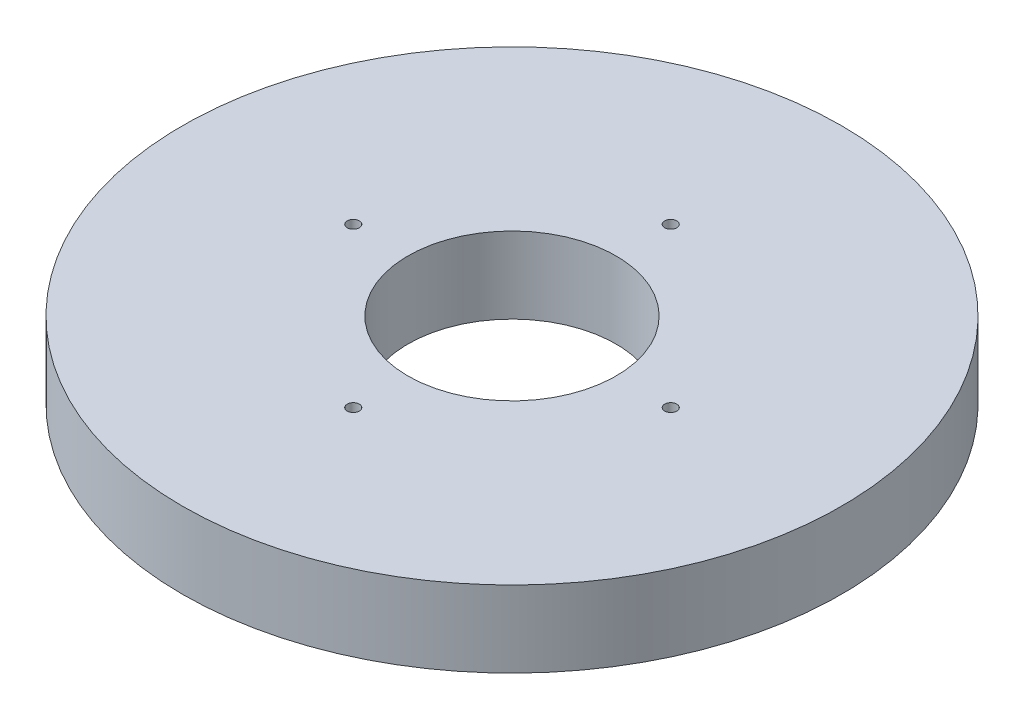
ISO-10303-21;
HEADER;
FILE_DESCRIPTION(('STEP AP214'),'2;1');
FILE_NAME('part.step','',(''),(''),'','','');
FILE_SCHEMA(('AUTOMOTIVE_DESIGN { 1 0 10303 214 1 1 1 1 }'));
ENDSEC;
DATA;
#1=APPLICATION_CONTEXT('core data for automotive mechanical design processes');
#2=APPLICATION_PROTOCOL_DEFINITION('international standard','automotive_design',2000,#1);
#3=PRODUCT_CONTEXT('',#1,'mechanical');
#4=PRODUCT('Part','Part','',(#3));
#5=PRODUCT_RELATED_PRODUCT_CATEGORY('part','',(#4));
#6=PRODUCT_DEFINITION_FORMATION('','',#4);
#7=PRODUCT_DEFINITION_CONTEXT('part definition',#1,'design');
#8=PRODUCT_DEFINITION('design','',#6,#7);
#9=PRODUCT_DEFINITION_SHAPE('','',#8);
#10=(LENGTH_UNIT() NAMED_UNIT(*) SI_UNIT(.MILLI.,.METRE.));
#11=(NAMED_UNIT(*) PLANE_ANGLE_UNIT() SI_UNIT($,.RADIAN.));
#12=(NAMED_UNIT(*) SI_UNIT($,.STERADIAN.) SOLID_ANGLE_UNIT());
#13=UNCERTAINTY_MEASURE_WITH_UNIT(LENGTH_MEASURE(1.E-05),#10,'distance_accuracy_value','');
#14=(GEOMETRIC_REPRESENTATION_CONTEXT(3) GLOBAL_UNCERTAINTY_ASSIGNED_CONTEXT((#13)) GLOBAL_UNIT_ASSIGNED_CONTEXT((#10,
#11,#12)) REPRESENTATION_CONTEXT('',''));
#15=CARTESIAN_POINT('',(0.,0.,0.));
#16=DIRECTION('',(0.,0.,1.));
#17=DIRECTION('',(1.,0.,0.));
#18=AXIS2_PLACEMENT_3D('',#15,#16,#17);
#19=CARTESIAN_POINT('',(0.,22.,0.));
#20=DIRECTION('',(0.,-1.,0.));
#21=DIRECTION('',(0.,0.,-1.));
#22=AXIS2_PLACEMENT_3D('',#19,#20,#21);
#23=CYLINDRICAL_SURFACE('',#22,95.);
#24=CARTESIAN_POINT('',(0.,22.,0.));
#25=DIRECTION('',(0.,1.,0.));
#26=DIRECTION('',(0.,0.,1.));
#27=AXIS2_PLACEMENT_3D('',#24,#25,#26);
#28=CIRCLE('',#27,95.);
#29=CARTESIAN_POINT('',(0.,22.,95.));
#30=VERTEX_POINT('',#29);
#31=EDGE_CURVE('E10',#30,#30,#28,.T.);
#32=ORIENTED_EDGE('',*,*,#31,.F.);
#33=EDGE_LOOP('',(#32));
#34=FACE_BOUND('',#33,.T.);
#35=CARTESIAN_POINT('',(0.,0.,0.));
#36=DIRECTION('',(0.,1.,0.));
#37=DIRECTION('',(0.,0.,1.));
#38=AXIS2_PLACEMENT_3D('',#35,#36,#37);
#39=CIRCLE('',#38,95.);
#40=CARTESIAN_POINT('',(0.,0.,95.));
#41=VERTEX_POINT('',#40);
#42=EDGE_CURVE('E37',#41,#41,#39,.T.);
#43=ORIENTED_EDGE('',*,*,#42,.T.);
#44=EDGE_LOOP('',(#43));
#45=FACE_BOUND('',#44,.T.);
#46=ADVANCED_FACE('F40',(#34,#45),#23,.T.);
#47=CARTESIAN_POINT('',(0.,22.,0.));
#48=DIRECTION('',(0.,1.,0.));
#49=DIRECTION('',(0.,0.,1.));
#50=AXIS2_PLACEMENT_3D('',#47,#48,#49);
#51=PLANE('',#50);
#52=CARTESIAN_POINT('',(1.59753871056288E-13,22.,45.755327195654));
#53=DIRECTION('',(0.,1.,0.));
#54=DIRECTION('',(1.,0.,0.));
#55=AXIS2_PLACEMENT_3D('',#52,#53,#54);
#56=CIRCLE('',#55,1.74434081196047);
#57=CARTESIAN_POINT('',(1.74434081196063,22.,45.755327195654));
#58=VERTEX_POINT('',#57);
#59=EDGE_CURVE('E71',#58,#58,#56,.T.);
#60=ORIENTED_EDGE('',*,*,#59,.F.);
#61=EDGE_LOOP('',(#60));
#62=FACE_BOUND('',#61,.T.);
#63=CARTESIAN_POINT('',(45.755327195654,22.,0.));
#64=DIRECTION('',(0.,1.,0.));
#65=DIRECTION('',(0.,0.,-1.));
#66=AXIS2_PLACEMENT_3D('',#63,#64,#65);
#67=CIRCLE('',#66,1.74434081196047);
#68=CARTESIAN_POINT('',(45.755327195654,22.,-1.74434081196047));
#69=VERTEX_POINT('',#68);
#70=EDGE_CURVE('E70',#69,#69,#67,.T.);
#71=ORIENTED_EDGE('',*,*,#70,.F.);
#72=EDGE_LOOP('',(#71));
#73=FACE_BOUND('',#72,.T.);
#74=CARTESIAN_POINT('',(-4.79261613168863E-13,22.,-45.755327195654));
#75=DIRECTION('',(0.,1.,0.));
#76=DIRECTION('',(-1.,0.,0.));
#77=AXIS2_PLACEMENT_3D('',#74,#75,#76);
#78=CIRCLE('',#77,1.74434081196047);
#79=CARTESIAN_POINT('',(-1.74434081196095,22.,-45.755327195654));
#80=VERTEX_POINT('',#79);
#81=EDGE_CURVE('E61',#80,#80,#78,.T.);
#82=ORIENTED_EDGE('',*,*,#81,.F.);
#83=EDGE_LOOP('',(#82));
#84=FACE_BOUND('',#83,.T.);
#85=CARTESIAN_POINT('',(-45.755327195654,22.,0.));
#86=DIRECTION('',(0.,1.,0.));
#87=DIRECTION('',(0.,0.,1.));
#88=AXIS2_PLACEMENT_3D('',#85,#86,#87);
#89=CIRCLE('',#88,1.74434081196047);
#90=CARTESIAN_POINT('',(-45.755327195654,22.,1.74434081196047));
#91=VERTEX_POINT('',#90);
#92=EDGE_CURVE('E54',#91,#91,#89,.T.);
#93=ORIENTED_EDGE('',*,*,#92,.F.);
#94=EDGE_LOOP('',(#93));
#95=FACE_BOUND('',#94,.T.);
#96=CARTESIAN_POINT('',(0.,22.,0.));
#97=DIRECTION('',(0.,1.,0.));
#98=DIRECTION('',(0.,0.,1.));
#99=AXIS2_PLACEMENT_3D('',#96,#97,#98);
#100=CIRCLE('',#99,30.);
#101=CARTESIAN_POINT('',(0.,22.,30.));
#102=VERTEX_POINT('',#101);
#103=EDGE_CURVE('E50',#102,#102,#100,.T.);
#104=ORIENTED_EDGE('',*,*,#103,.F.);
#105=EDGE_LOOP('',(#104));
#106=FACE_BOUND('',#105,.T.);
#107=ORIENTED_EDGE('',*,*,#31,.T.);
#108=EDGE_LOOP('',(#107));
#109=FACE_BOUND('',#108,.T.);
#110=ADVANCED_FACE('F86',(#62,#73,#84,#95,#106,#109),#51,.T.);
#111=CARTESIAN_POINT('',(0.,0.,0.));
#112=DIRECTION('',(0.,1.,0.));
#113=DIRECTION('',(0.,0.,1.));
#114=AXIS2_PLACEMENT_3D('',#111,#112,#113);
#115=PLANE('',#114);
#116=CARTESIAN_POINT('',(0.,0.,0.));
#117=DIRECTION('',(0.,1.,0.));
#118=DIRECTION('',(0.,0.,1.));
#119=AXIS2_PLACEMENT_3D('',#116,#117,#118);
#120=CIRCLE('',#119,30.);
#121=CARTESIAN_POINT('',(0.,0.,30.));
#122=VERTEX_POINT('',#121);
#123=EDGE_CURVE('E47',#122,#122,#120,.T.);
#124=ORIENTED_EDGE('',*,*,#123,.T.);
#125=EDGE_LOOP('',(#124));
#126=FACE_BOUND('',#125,.T.);
#127=ORIENTED_EDGE('',*,*,#42,.F.);
#128=EDGE_LOOP('',(#127));
#129=FACE_BOUND('',#128,.T.);
#130=ADVANCED_FACE('F93',(#126,#129),#115,.F.);
#131=CARTESIAN_POINT('',(0.,22.,0.));
#132=DIRECTION('',(0.,-1.,0.));
#133=DIRECTION('',(0.,0.,-1.));
#134=AXIS2_PLACEMENT_3D('',#131,#132,#133);
#135=CYLINDRICAL_SURFACE('',#134,30.);
#136=ORIENTED_EDGE('',*,*,#103,.T.);
#137=EDGE_LOOP('',(#136));
#138=FACE_BOUND('',#137,.T.);
#139=ORIENTED_EDGE('',*,*,#123,.F.);
#140=EDGE_LOOP('',(#139));
#141=FACE_BOUND('',#140,.T.);
#142=ADVANCED_FACE('F101',(#138,#141),#135,.F.);
#143=CARTESIAN_POINT('',(-45.755327195654,0.248883736838203,0.));
#144=DIRECTION('',(0.,1.,0.));
#145=DIRECTION('',(0.,0.,1.));
#146=AXIS2_PLACEMENT_3D('',#143,#144,#145);
#147=CYLINDRICAL_SURFACE('',#146,1.74434081196047);
#148=CARTESIAN_POINT('',(-45.755327195654,0.248883736838203,0.));
#149=DIRECTION('',(0.,1.,0.));
#150=DIRECTION('',(0.,0.,1.));
#151=AXIS2_PLACEMENT_3D('',#148,#149,#150);
#152=CIRCLE('',#151,1.74434081196047);
#153=CARTESIAN_POINT('',(-45.755327195654,0.248883736838203,1.74434081196047));
#154=VERTEX_POINT('',#153);
#155=EDGE_CURVE('E55',#154,#154,#152,.T.);
#156=ORIENTED_EDGE('',*,*,#155,.F.);
#157=EDGE_LOOP('',(#156));
#158=FACE_BOUND('',#157,.T.);
#159=ORIENTED_EDGE('',*,*,#92,.T.);
#160=EDGE_LOOP('',(#159));
#161=FACE_BOUND('',#160,.T.);
#162=ADVANCED_FACE('F102',(#158,#161),#147,.F.);
#163=CARTESIAN_POINT('',(-45.755327195654,0.248883736838203,0.));
#164=DIRECTION('',(0.,1.,0.));
#165=DIRECTION('',(0.,0.,1.));
#166=AXIS2_PLACEMENT_3D('',#163,#164,#165);
#167=PLANE('',#166);
#168=ORIENTED_EDGE('',*,*,#155,.T.);
#169=EDGE_LOOP('',(#168));
#170=FACE_BOUND('',#169,.T.);
#171=ADVANCED_FACE('F133',(#170),#167,.T.);
#172=CARTESIAN_POINT('',(-4.79261613168863E-13,0.248883736838203,-45.755327195654));
#173=DIRECTION('',(0.,1.,0.));
#174=DIRECTION('',(0.,0.,1.));
#175=AXIS2_PLACEMENT_3D('',#172,#173,#174);
#176=CYLINDRICAL_SURFACE('',#175,1.74434081196047);
#177=CARTESIAN_POINT('',(-4.79261613168863E-13,0.248883736838203,-45.755327195654));
#178=DIRECTION('',(0.,1.,0.));
#179=DIRECTION('',(-1.,0.,0.));
#180=AXIS2_PLACEMENT_3D('',#177,#178,#179);
#181=CIRCLE('',#180,1.74434081196047);
#182=CARTESIAN_POINT('',(-1.74434081196095,0.248883736838203,-45.755327195654));
#183=VERTEX_POINT('',#182);
#184=EDGE_CURVE('E63',#183,#183,#181,.T.);
#185=ORIENTED_EDGE('',*,*,#184,.F.);
#186=EDGE_LOOP('',(#185));
#187=FACE_BOUND('',#186,.T.);
#188=ORIENTED_EDGE('',*,*,#81,.T.);
#189=EDGE_LOOP('',(#188));
#190=FACE_BOUND('',#189,.T.);
#191=ADVANCED_FACE('F142',(#187,#190),#176,.F.);
#192=CARTESIAN_POINT('',(-4.79261613168863E-13,0.248883736838203,-45.755327195654));
#193=DIRECTION('',(0.,1.,0.));
#194=DIRECTION('',(-1.,0.,0.));
#195=AXIS2_PLACEMENT_3D('',#192,#193,#194);
#196=PLANE('',#195);
#197=ORIENTED_EDGE('',*,*,#184,.T.);
#198=EDGE_LOOP('',(#197));
#199=FACE_BOUND('',#198,.T.);
#200=ADVANCED_FACE('F156',(#199),#196,.T.);
#201=CARTESIAN_POINT('',(45.755327195654,0.248883736838203,0.));
#202=DIRECTION('',(0.,1.,0.));
#203=DIRECTION('',(0.,0.,1.));
#204=AXIS2_PLACEMENT_3D('',#201,#202,#203);
#205=CYLINDRICAL_SURFACE('',#204,1.74434081196047);
#206=CARTESIAN_POINT('',(45.755327195654,0.248883736838203,0.));
#207=DIRECTION('',(0.,1.,0.));
#208=DIRECTION('',(0.,0.,-1.));
#209=AXIS2_PLACEMENT_3D('',#206,#207,#208);
#210=CIRCLE('',#209,1.74434081196047);
#211=CARTESIAN_POINT('',(45.755327195654,0.248883736838203,-1.74434081196047));
#212=VERTEX_POINT('',#211);
#213=EDGE_CURVE('E69',#212,#212,#210,.T.);
#214=ORIENTED_EDGE('',*,*,#213,.F.);
#215=EDGE_LOOP('',(#214));
#216=FACE_BOUND('',#215,.T.);
#217=ORIENTED_EDGE('',*,*,#70,.T.);
#218=EDGE_LOOP('',(#217));
#219=FACE_BOUND('',#218,.T.);
#220=ADVANCED_FACE('F164',(#216,#219),#205,.F.);
#221=CARTESIAN_POINT('',(45.755327195654,0.248883736838203,0.));
#222=DIRECTION('',(0.,1.,0.));
#223=DIRECTION('',(0.,0.,-1.));
#224=AXIS2_PLACEMENT_3D('',#221,#222,#223);
#225=PLANE('',#224);
#226=ORIENTED_EDGE('',*,*,#213,.T.);
#227=EDGE_LOOP('',(#226));
#228=FACE_BOUND('',#227,.T.);
#229=ADVANCED_FACE('F83',(#228),#225,.T.);
#230=CARTESIAN_POINT('',(1.59753871056288E-13,0.248883736838203,45.755327195654));
#231=DIRECTION('',(0.,1.,0.));
#232=DIRECTION('',(0.,0.,1.));
#233=AXIS2_PLACEMENT_3D('',#230,#231,#232);
#234=CYLINDRICAL_SURFACE('',#233,1.74434081196047);
#235=CARTESIAN_POINT('',(1.59753871056288E-13,0.248883736838203,45.755327195654));
#236=DIRECTION('',(0.,1.,0.));
#237=DIRECTION('',(1.,0.,0.));
#238=AXIS2_PLACEMENT_3D('',#235,#236,#237);
#239=CIRCLE('',#238,1.74434081196047);
#240=CARTESIAN_POINT('',(1.74434081196063,0.248883736838203,45.755327195654));
#241=VERTEX_POINT('',#240);
#242=EDGE_CURVE('E59',#241,#241,#239,.T.);
#243=ORIENTED_EDGE('',*,*,#242,.F.);
#244=EDGE_LOOP('',(#243));
#245=FACE_BOUND('',#244,.T.);
#246=ORIENTED_EDGE('',*,*,#59,.T.);
#247=EDGE_LOOP('',(#246));
#248=FACE_BOUND('',#247,.T.);
#249=ADVANCED_FACE('F81',(#245,#248),#234,.F.);
#250=CARTESIAN_POINT('',(1.59753871056288E-13,0.248883736838203,45.755327195654));
#251=DIRECTION('',(0.,1.,0.));
#252=DIRECTION('',(1.,0.,0.));
#253=AXIS2_PLACEMENT_3D('',#250,#251,#252);
#254=PLANE('',#253);
#255=ORIENTED_EDGE('',*,*,#242,.T.);
#256=EDGE_LOOP('',(#255));
#257=FACE_BOUND('',#256,.T.);
#258=ADVANCED_FACE('F78',(#257),#254,.T.);
#259=CLOSED_SHELL('',(#46,#110,#130,#142,#162,#171,#191,#200,#220,#229,#249,#258));
#260=MANIFOLD_SOLID_BREP('B2',#259);
#261=ADVANCED_BREP_SHAPE_REPRESENTATION('',(#18,#260),#14);
#262=SHAPE_DEFINITION_REPRESENTATION(#9,#261);
ENDSEC;
END-ISO-10303-21;
